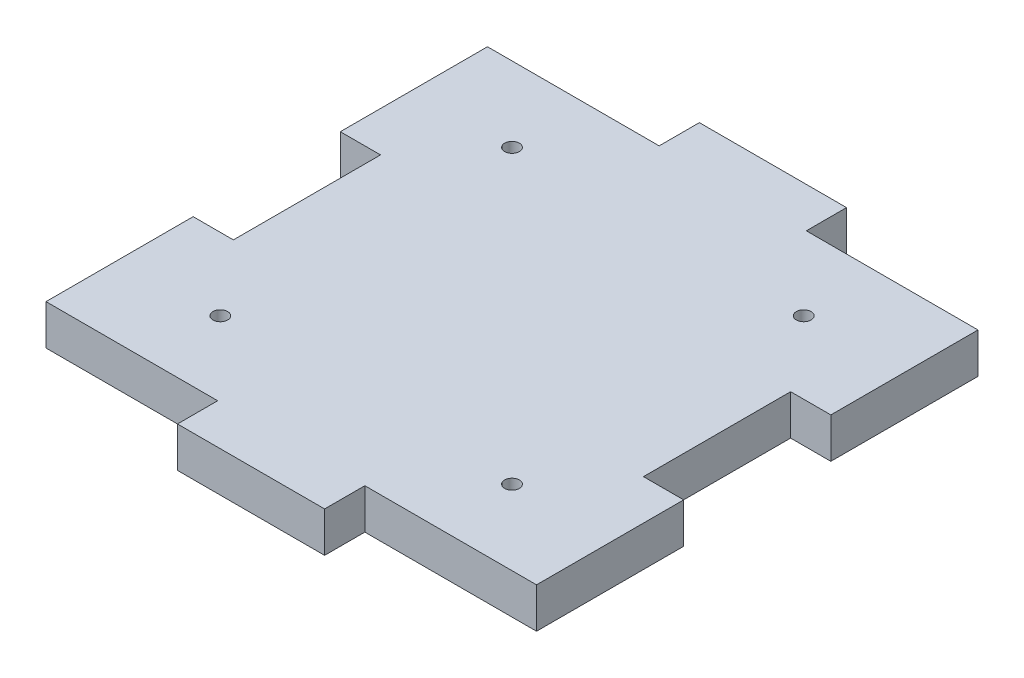
ISO-10303-21;
HEADER;
FILE_DESCRIPTION(('STEP AP214'),'2;1');
FILE_NAME('part.step','',(''),(''),'','','');
FILE_SCHEMA(('AUTOMOTIVE_DESIGN { 1 0 10303 214 1 1 1 1 }'));
ENDSEC;
DATA;
#1=APPLICATION_CONTEXT('core data for automotive mechanical design processes');
#2=APPLICATION_PROTOCOL_DEFINITION('international standard','automotive_design',2000,#1);
#3=PRODUCT_CONTEXT('',#1,'mechanical');
#4=PRODUCT('Part','Part','',(#3));
#5=PRODUCT_RELATED_PRODUCT_CATEGORY('part','',(#4));
#6=PRODUCT_DEFINITION_FORMATION('','',#4);
#7=PRODUCT_DEFINITION_CONTEXT('part definition',#1,'design');
#8=PRODUCT_DEFINITION('design','',#6,#7);
#9=PRODUCT_DEFINITION_SHAPE('','',#8);
#10=(LENGTH_UNIT() NAMED_UNIT(*) SI_UNIT(.MILLI.,.METRE.));
#11=(NAMED_UNIT(*) PLANE_ANGLE_UNIT() SI_UNIT($,.RADIAN.));
#12=(NAMED_UNIT(*) SI_UNIT($,.STERADIAN.) SOLID_ANGLE_UNIT());
#13=UNCERTAINTY_MEASURE_WITH_UNIT(LENGTH_MEASURE(1.E-05),#10,'distance_accuracy_value','');
#14=(GEOMETRIC_REPRESENTATION_CONTEXT(3) GLOBAL_UNCERTAINTY_ASSIGNED_CONTEXT((#13)) GLOBAL_UNIT_ASSIGNED_CONTEXT((#10,
#11,#12)) REPRESENTATION_CONTEXT('',''));
#15=CARTESIAN_POINT('',(0.,0.,0.));
#16=DIRECTION('',(0.,0.,1.));
#17=DIRECTION('',(1.,0.,0.));
#18=AXIS2_PLACEMENT_3D('',#15,#16,#17);
#19=CARTESIAN_POINT('',(0.,4.1,0.));
#20=DIRECTION('',(0.,-1.,0.));
#21=DIRECTION('',(0.,0.,-1.));
#22=AXIS2_PLACEMENT_3D('',#19,#20,#21);
#23=PLANE('',#22);
#24=CARTESIAN_POINT('',(39.8669200744472,4.1,-37.3669200744472));
#25=DIRECTION('',(0.,1.,0.));
#26=DIRECTION('',(0.,0.,1.));
#27=AXIS2_PLACEMENT_3D('',#24,#25,#26);
#28=CIRCLE('',#27,0.749999999999999);
#29=CARTESIAN_POINT('',(39.8669200744472,4.1,-36.6169200744472));
#30=VERTEX_POINT('',#29);
#31=EDGE_CURVE('E395',#30,#30,#28,.T.);
#32=ORIENTED_EDGE('',*,*,#31,.F.);
#33=EDGE_LOOP('',(#32));
#34=FACE_BOUND('',#33,.T.);
#35=CARTESIAN_POINT('',(10.1330799255528,4.1,-7.63307992555285));
#36=DIRECTION('',(0.,1.,0.));
#37=DIRECTION('',(0.,0.,1.));
#38=AXIS2_PLACEMENT_3D('',#35,#36,#37);
#39=CIRCLE('',#38,0.75);
#40=CARTESIAN_POINT('',(10.1330799255528,4.1,-6.88307992555285));
#41=VERTEX_POINT('',#40);
#42=EDGE_CURVE('E205',#41,#41,#39,.T.);
#43=ORIENTED_EDGE('',*,*,#42,.F.);
#44=EDGE_LOOP('',(#43));
#45=FACE_BOUND('',#44,.T.);
#46=DIRECTION('',(1.,0.,0.));
#47=VECTOR('',#46,1.);
#48=CARTESIAN_POINT('',(17.5,4.1,0.));
#49=LINE('',#48,#47);
#50=CARTESIAN_POINT('',(0.,4.1,0.));
#51=VERTEX_POINT('',#50);
#52=CARTESIAN_POINT('',(17.5,4.1,0.));
#53=VERTEX_POINT('',#52);
#54=EDGE_CURVE('E240',#51,#53,#49,.T.);
#55=ORIENTED_EDGE('',*,*,#54,.T.);
#56=DIRECTION('',(0.,0.,1.));
#57=VECTOR('',#56,1.);
#58=CARTESIAN_POINT('',(17.5,4.1,4.10000000000001));
#59=LINE('',#58,#57);
#60=CARTESIAN_POINT('',(17.5,4.1,4.10000000000001));
#61=VERTEX_POINT('',#60);
#62=EDGE_CURVE('E128',#53,#61,#59,.T.);
#63=ORIENTED_EDGE('',*,*,#62,.T.);
#64=DIRECTION('',(1.,0.,0.));
#65=VECTOR('',#64,1.);
#66=CARTESIAN_POINT('',(32.5,4.1,4.10000000000001));
#67=LINE('',#66,#65);
#68=CARTESIAN_POINT('',(32.5,4.1,4.10000000000001));
#69=VERTEX_POINT('',#68);
#70=EDGE_CURVE('E291',#61,#69,#67,.T.);
#71=ORIENTED_EDGE('',*,*,#70,.T.);
#72=DIRECTION('',(0.,0.,-1.));
#73=VECTOR('',#72,1.);
#74=CARTESIAN_POINT('',(32.5,4.1,0.));
#75=LINE('',#74,#73);
#76=CARTESIAN_POINT('',(32.5,4.1,0.));
#77=VERTEX_POINT('',#76);
#78=EDGE_CURVE('E310',#69,#77,#75,.T.);
#79=ORIENTED_EDGE('',*,*,#78,.T.);
#80=DIRECTION('',(1.,0.,0.));
#81=VECTOR('',#80,1.);
#82=CARTESIAN_POINT('',(50.,4.1,0.));
#83=LINE('',#82,#81);
#84=CARTESIAN_POINT('',(50.,4.1,0.));
#85=VERTEX_POINT('',#84);
#86=EDGE_CURVE('E307',#77,#85,#83,.T.);
#87=ORIENTED_EDGE('',*,*,#86,.T.);
#88=DIRECTION('',(0.,0.,-1.));
#89=VECTOR('',#88,1.);
#90=CARTESIAN_POINT('',(50.,4.1,-15.));
#91=LINE('',#90,#89);
#92=CARTESIAN_POINT('',(50.,4.1,-15.));
#93=VERTEX_POINT('',#92);
#94=EDGE_CURVE('E309',#85,#93,#91,.T.);
#95=ORIENTED_EDGE('',*,*,#94,.T.);
#96=DIRECTION('',(-1.,0.,0.));
#97=VECTOR('',#96,1.);
#98=CARTESIAN_POINT('',(45.9,4.1,-15.));
#99=LINE('',#98,#97);
#100=CARTESIAN_POINT('',(45.9,4.1,-15.));
#101=VERTEX_POINT('',#100);
#102=EDGE_CURVE('E312',#93,#101,#99,.T.);
#103=ORIENTED_EDGE('',*,*,#102,.T.);
#104=DIRECTION('',(0.,0.,-1.));
#105=VECTOR('',#104,1.);
#106=CARTESIAN_POINT('',(45.9,4.1,-30.));
#107=LINE('',#106,#105);
#108=CARTESIAN_POINT('',(45.9,4.1,-30.));
#109=VERTEX_POINT('',#108);
#110=EDGE_CURVE('E318',#101,#109,#107,.T.);
#111=ORIENTED_EDGE('',*,*,#110,.T.);
#112=DIRECTION('',(1.,0.,0.));
#113=VECTOR('',#112,1.);
#114=CARTESIAN_POINT('',(50.,4.1,-30.));
#115=LINE('',#114,#113);
#116=CARTESIAN_POINT('',(50.,4.1,-30.));
#117=VERTEX_POINT('',#116);
#118=EDGE_CURVE('E320',#109,#117,#115,.T.);
#119=ORIENTED_EDGE('',*,*,#118,.T.);
#120=DIRECTION('',(0.,0.,-1.));
#121=VECTOR('',#120,1.);
#122=CARTESIAN_POINT('',(50.,4.1,-45.));
#123=LINE('',#122,#121);
#124=CARTESIAN_POINT('',(50.,4.1,-45.));
#125=VERTEX_POINT('',#124);
#126=EDGE_CURVE('E322',#117,#125,#123,.T.);
#127=ORIENTED_EDGE('',*,*,#126,.T.);
#128=DIRECTION('',(-1.,0.,0.));
#129=VECTOR('',#128,1.);
#130=CARTESIAN_POINT('',(50.,4.1,-45.));
#131=LINE('',#130,#129);
#132=CARTESIAN_POINT('',(32.5,4.1,-45.));
#133=VERTEX_POINT('',#132);
#134=EDGE_CURVE('E324',#125,#133,#131,.T.);
#135=ORIENTED_EDGE('',*,*,#134,.T.);
#136=DIRECTION('',(0.,0.,-1.));
#137=VECTOR('',#136,1.);
#138=CARTESIAN_POINT('',(32.5,4.1,-45.));
#139=LINE('',#138,#137);
#140=CARTESIAN_POINT('',(32.5,4.1,-49.1));
#141=VERTEX_POINT('',#140);
#142=EDGE_CURVE('E326',#133,#141,#139,.T.);
#143=ORIENTED_EDGE('',*,*,#142,.T.);
#144=DIRECTION('',(-1.,0.,0.));
#145=VECTOR('',#144,1.);
#146=CARTESIAN_POINT('',(32.5,4.1,-49.1));
#147=LINE('',#146,#145);
#148=CARTESIAN_POINT('',(17.5,4.1,-49.1));
#149=VERTEX_POINT('',#148);
#150=EDGE_CURVE('E328',#141,#149,#147,.T.);
#151=ORIENTED_EDGE('',*,*,#150,.T.);
#152=DIRECTION('',(0.,0.,1.));
#153=VECTOR('',#152,1.);
#154=CARTESIAN_POINT('',(17.5,4.1,-49.1));
#155=LINE('',#154,#153);
#156=CARTESIAN_POINT('',(17.5,4.1,-45.));
#157=VERTEX_POINT('',#156);
#158=EDGE_CURVE('E330',#149,#157,#155,.T.);
#159=ORIENTED_EDGE('',*,*,#158,.T.);
#160=DIRECTION('',(-1.,0.,0.));
#161=VECTOR('',#160,1.);
#162=CARTESIAN_POINT('',(17.5,4.1,-45.));
#163=LINE('',#162,#161);
#164=CARTESIAN_POINT('',(0.,4.1,-45.));
#165=VERTEX_POINT('',#164);
#166=EDGE_CURVE('E332',#157,#165,#163,.T.);
#167=ORIENTED_EDGE('',*,*,#166,.T.);
#168=DIRECTION('',(0.,0.,1.));
#169=VECTOR('',#168,1.);
#170=CARTESIAN_POINT('',(0.,4.1,-30.));
#171=LINE('',#170,#169);
#172=CARTESIAN_POINT('',(0.,4.1,-30.));
#173=VERTEX_POINT('',#172);
#174=EDGE_CURVE('E334',#165,#173,#171,.T.);
#175=ORIENTED_EDGE('',*,*,#174,.T.);
#176=DIRECTION('',(1.,0.,0.));
#177=VECTOR('',#176,1.);
#178=CARTESIAN_POINT('',(4.1,4.1,-30.));
#179=LINE('',#178,#177);
#180=CARTESIAN_POINT('',(4.1,4.1,-30.));
#181=VERTEX_POINT('',#180);
#182=EDGE_CURVE('E183',#173,#181,#179,.T.);
#183=ORIENTED_EDGE('',*,*,#182,.T.);
#184=DIRECTION('',(0.,0.,1.));
#185=VECTOR('',#184,1.);
#186=CARTESIAN_POINT('',(4.1,4.1,-15.));
#187=LINE('',#186,#185);
#188=CARTESIAN_POINT('',(4.1,4.1,-15.));
#189=VERTEX_POINT('',#188);
#190=EDGE_CURVE('E177',#181,#189,#187,.T.);
#191=ORIENTED_EDGE('',*,*,#190,.T.);
#192=DIRECTION('',(-1.,0.,0.));
#193=VECTOR('',#192,1.);
#194=CARTESIAN_POINT('',(0.,4.1,-15.));
#195=LINE('',#194,#193);
#196=CARTESIAN_POINT('',(0.,4.1,-15.));
#197=VERTEX_POINT('',#196);
#198=EDGE_CURVE('E181',#189,#197,#195,.T.);
#199=ORIENTED_EDGE('',*,*,#198,.T.);
#200=DIRECTION('',(0.,0.,1.));
#201=VECTOR('',#200,1.);
#202=CARTESIAN_POINT('',(0.,4.1,0.));
#203=LINE('',#202,#201);
#204=EDGE_CURVE('E49',#197,#51,#203,.T.);
#205=ORIENTED_EDGE('',*,*,#204,.T.);
#206=EDGE_LOOP('',(#55,#63,#71,#79,#87,#95,#103,#111,#119,#127,#135,#143,#151,#159,#167,#175,
#183,#191,#199,#205));
#207=FACE_BOUND('',#206,.T.);
#208=CARTESIAN_POINT('',(10.1330799255528,4.1,-37.3669200744472));
#209=DIRECTION('',(0.,1.,0.));
#210=DIRECTION('',(0.,0.,1.));
#211=AXIS2_PLACEMENT_3D('',#208,#209,#210);
#212=CIRCLE('',#211,0.75);
#213=CARTESIAN_POINT('',(10.1330799255528,4.1,-36.6169200744472));
#214=VERTEX_POINT('',#213);
#215=EDGE_CURVE('E401',#214,#214,#212,.T.);
#216=ORIENTED_EDGE('',*,*,#215,.F.);
#217=EDGE_LOOP('',(#216));
#218=FACE_BOUND('',#217,.T.);
#219=CARTESIAN_POINT('',(39.8669200744472,4.1,-7.63307992555285));
#220=DIRECTION('',(0.,1.,0.));
#221=DIRECTION('',(0.,0.,1.));
#222=AXIS2_PLACEMENT_3D('',#219,#220,#221);
#223=CIRCLE('',#222,0.749999999999999);
#224=CARTESIAN_POINT('',(39.8669200744472,4.1,-6.88307992555285));
#225=VERTEX_POINT('',#224);
#226=EDGE_CURVE('E386',#225,#225,#223,.T.);
#227=ORIENTED_EDGE('',*,*,#226,.F.);
#228=EDGE_LOOP('',(#227));
#229=FACE_BOUND('',#228,.T.);
#230=ADVANCED_FACE('F32',(#34,#45,#207,#218,#229),#23,.F.);
#231=CARTESIAN_POINT('',(0.,0.,0.));
#232=DIRECTION('',(0.,-1.,0.));
#233=DIRECTION('',(0.,0.,-1.));
#234=AXIS2_PLACEMENT_3D('',#231,#232,#233);
#235=PLANE('',#234);
#236=CARTESIAN_POINT('',(39.8669200744472,0.,-37.3669200744472));
#237=DIRECTION('',(0.,1.,0.));
#238=DIRECTION('',(0.,0.,1.));
#239=AXIS2_PLACEMENT_3D('',#236,#237,#238);
#240=CIRCLE('',#239,0.749999999999999);
#241=CARTESIAN_POINT('',(39.8669200744472,0.,-36.6169200744472));
#242=VERTEX_POINT('',#241);
#243=EDGE_CURVE('E392',#242,#242,#240,.T.);
#244=ORIENTED_EDGE('',*,*,#243,.T.);
#245=EDGE_LOOP('',(#244));
#246=FACE_BOUND('',#245,.T.);
#247=CARTESIAN_POINT('',(10.1330799255528,0.,-7.63307992555285));
#248=DIRECTION('',(0.,1.,0.));
#249=DIRECTION('',(0.,0.,1.));
#250=AXIS2_PLACEMENT_3D('',#247,#248,#249);
#251=CIRCLE('',#250,0.75);
#252=CARTESIAN_POINT('',(10.1330799255528,0.,-6.88307992555285));
#253=VERTEX_POINT('',#252);
#254=EDGE_CURVE('E404',#253,#253,#251,.T.);
#255=ORIENTED_EDGE('',*,*,#254,.T.);
#256=EDGE_LOOP('',(#255));
#257=FACE_BOUND('',#256,.T.);
#258=DIRECTION('',(1.,0.,0.));
#259=VECTOR('',#258,1.);
#260=CARTESIAN_POINT('',(17.5,0.,0.));
#261=LINE('',#260,#259);
#262=CARTESIAN_POINT('',(0.,0.,0.));
#263=VERTEX_POINT('',#262);
#264=CARTESIAN_POINT('',(17.5,0.,0.));
#265=VERTEX_POINT('',#264);
#266=EDGE_CURVE('E201',#263,#265,#261,.T.);
#267=ORIENTED_EDGE('',*,*,#266,.F.);
#268=DIRECTION('',(0.,0.,1.));
#269=VECTOR('',#268,1.);
#270=CARTESIAN_POINT('',(0.,0.,0.));
#271=LINE('',#270,#269);
#272=CARTESIAN_POINT('',(0.,0.,-15.));
#273=VERTEX_POINT('',#272);
#274=EDGE_CURVE('E120',#273,#263,#271,.T.);
#275=ORIENTED_EDGE('',*,*,#274,.F.);
#276=DIRECTION('',(-1.,0.,0.));
#277=VECTOR('',#276,1.);
#278=CARTESIAN_POINT('',(0.,0.,-15.));
#279=LINE('',#278,#277);
#280=CARTESIAN_POINT('',(4.1,0.,-15.));
#281=VERTEX_POINT('',#280);
#282=EDGE_CURVE('E114',#281,#273,#279,.T.);
#283=ORIENTED_EDGE('',*,*,#282,.F.);
#284=DIRECTION('',(0.,0.,1.));
#285=VECTOR('',#284,1.);
#286=CARTESIAN_POINT('',(4.1,0.,-15.));
#287=LINE('',#286,#285);
#288=CARTESIAN_POINT('',(4.1,0.,-30.));
#289=VERTEX_POINT('',#288);
#290=EDGE_CURVE('E191',#289,#281,#287,.T.);
#291=ORIENTED_EDGE('',*,*,#290,.F.);
#292=DIRECTION('',(1.,0.,0.));
#293=VECTOR('',#292,1.);
#294=CARTESIAN_POINT('',(4.1,0.,-30.));
#295=LINE('',#294,#293);
#296=CARTESIAN_POINT('',(0.,0.,-30.));
#297=VERTEX_POINT('',#296);
#298=EDGE_CURVE('E235',#297,#289,#295,.T.);
#299=ORIENTED_EDGE('',*,*,#298,.F.);
#300=DIRECTION('',(0.,0.,1.));
#301=VECTOR('',#300,1.);
#302=CARTESIAN_POINT('',(0.,0.,-30.));
#303=LINE('',#302,#301);
#304=CARTESIAN_POINT('',(0.,0.,-45.));
#305=VERTEX_POINT('',#304);
#306=EDGE_CURVE('E233',#305,#297,#303,.T.);
#307=ORIENTED_EDGE('',*,*,#306,.F.);
#308=DIRECTION('',(-1.,0.,0.));
#309=VECTOR('',#308,1.);
#310=CARTESIAN_POINT('',(17.5,0.,-45.));
#311=LINE('',#310,#309);
#312=CARTESIAN_POINT('',(17.5,0.,-45.));
#313=VERTEX_POINT('',#312);
#314=EDGE_CURVE('E231',#313,#305,#311,.T.);
#315=ORIENTED_EDGE('',*,*,#314,.F.);
#316=DIRECTION('',(0.,0.,1.));
#317=VECTOR('',#316,1.);
#318=CARTESIAN_POINT('',(17.5,0.,-49.1));
#319=LINE('',#318,#317);
#320=CARTESIAN_POINT('',(17.5,0.,-49.1));
#321=VERTEX_POINT('',#320);
#322=EDGE_CURVE('E229',#321,#313,#319,.T.);
#323=ORIENTED_EDGE('',*,*,#322,.F.);
#324=DIRECTION('',(-1.,0.,0.));
#325=VECTOR('',#324,1.);
#326=CARTESIAN_POINT('',(32.5,0.,-49.1));
#327=LINE('',#326,#325);
#328=CARTESIAN_POINT('',(32.5,0.,-49.1));
#329=VERTEX_POINT('',#328);
#330=EDGE_CURVE('E227',#329,#321,#327,.T.);
#331=ORIENTED_EDGE('',*,*,#330,.F.);
#332=DIRECTION('',(0.,0.,-1.));
#333=VECTOR('',#332,1.);
#334=CARTESIAN_POINT('',(32.5,0.,-45.));
#335=LINE('',#334,#333);
#336=CARTESIAN_POINT('',(32.5,0.,-45.));
#337=VERTEX_POINT('',#336);
#338=EDGE_CURVE('E225',#337,#329,#335,.T.);
#339=ORIENTED_EDGE('',*,*,#338,.F.);
#340=DIRECTION('',(-1.,0.,0.));
#341=VECTOR('',#340,1.);
#342=CARTESIAN_POINT('',(50.,0.,-45.));
#343=LINE('',#342,#341);
#344=CARTESIAN_POINT('',(50.,0.,-45.));
#345=VERTEX_POINT('',#344);
#346=EDGE_CURVE('E223',#345,#337,#343,.T.);
#347=ORIENTED_EDGE('',*,*,#346,.F.);
#348=DIRECTION('',(0.,0.,-1.));
#349=VECTOR('',#348,1.);
#350=CARTESIAN_POINT('',(50.,0.,-45.));
#351=LINE('',#350,#349);
#352=CARTESIAN_POINT('',(50.,0.,-30.));
#353=VERTEX_POINT('',#352);
#354=EDGE_CURVE('E221',#353,#345,#351,.T.);
#355=ORIENTED_EDGE('',*,*,#354,.F.);
#356=DIRECTION('',(1.,0.,0.));
#357=VECTOR('',#356,1.);
#358=CARTESIAN_POINT('',(50.,0.,-30.));
#359=LINE('',#358,#357);
#360=CARTESIAN_POINT('',(45.9,0.,-30.));
#361=VERTEX_POINT('',#360);
#362=EDGE_CURVE('E219',#361,#353,#359,.T.);
#363=ORIENTED_EDGE('',*,*,#362,.F.);
#364=DIRECTION('',(0.,0.,-1.));
#365=VECTOR('',#364,1.);
#366=CARTESIAN_POINT('',(45.9,0.,-30.));
#367=LINE('',#366,#365);
#368=CARTESIAN_POINT('',(45.9,0.,-15.));
#369=VERTEX_POINT('',#368);
#370=EDGE_CURVE('E217',#369,#361,#367,.T.);
#371=ORIENTED_EDGE('',*,*,#370,.F.);
#372=DIRECTION('',(-1.,0.,0.));
#373=VECTOR('',#372,1.);
#374=CARTESIAN_POINT('',(45.9,0.,-15.));
#375=LINE('',#374,#373);
#376=CARTESIAN_POINT('',(50.,0.,-15.));
#377=VERTEX_POINT('',#376);
#378=EDGE_CURVE('E215',#377,#369,#375,.T.);
#379=ORIENTED_EDGE('',*,*,#378,.F.);
#380=DIRECTION('',(0.,0.,-1.));
#381=VECTOR('',#380,1.);
#382=CARTESIAN_POINT('',(50.,0.,-15.));
#383=LINE('',#382,#381);
#384=CARTESIAN_POINT('',(50.,0.,0.));
#385=VERTEX_POINT('',#384);
#386=EDGE_CURVE('E213',#385,#377,#383,.T.);
#387=ORIENTED_EDGE('',*,*,#386,.F.);
#388=DIRECTION('',(1.,0.,0.));
#389=VECTOR('',#388,1.);
#390=CARTESIAN_POINT('',(50.,0.,0.));
#391=LINE('',#390,#389);
#392=CARTESIAN_POINT('',(32.5,0.,0.));
#393=VERTEX_POINT('',#392);
#394=EDGE_CURVE('E211',#393,#385,#391,.T.);
#395=ORIENTED_EDGE('',*,*,#394,.F.);
#396=DIRECTION('',(0.,0.,-1.));
#397=VECTOR('',#396,1.);
#398=CARTESIAN_POINT('',(32.5,0.,0.));
#399=LINE('',#398,#397);
#400=CARTESIAN_POINT('',(32.5,0.,4.10000000000001));
#401=VERTEX_POINT('',#400);
#402=EDGE_CURVE('E209',#401,#393,#399,.T.);
#403=ORIENTED_EDGE('',*,*,#402,.F.);
#404=DIRECTION('',(1.,0.,0.));
#405=VECTOR('',#404,1.);
#406=CARTESIAN_POINT('',(32.5,0.,4.10000000000001));
#407=LINE('',#406,#405);
#408=CARTESIAN_POINT('',(17.5,0.,4.10000000000001));
#409=VERTEX_POINT('',#408);
#410=EDGE_CURVE('E207',#409,#401,#407,.T.);
#411=ORIENTED_EDGE('',*,*,#410,.F.);
#412=DIRECTION('',(0.,0.,1.));
#413=VECTOR('',#412,1.);
#414=CARTESIAN_POINT('',(17.5,0.,4.10000000000001));
#415=LINE('',#414,#413);
#416=EDGE_CURVE('E204',#265,#409,#415,.T.);
#417=ORIENTED_EDGE('',*,*,#416,.F.);
#418=EDGE_LOOP('',(#267,#275,#283,#291,#299,#307,#315,#323,#331,#339,#347,#355,#363,#371,#379,
#387,#395,#403,#411,#417));
#419=FACE_BOUND('',#418,.T.);
#420=CARTESIAN_POINT('',(10.1330799255528,0.,-37.3669200744472));
#421=DIRECTION('',(0.,1.,0.));
#422=DIRECTION('',(0.,0.,1.));
#423=AXIS2_PLACEMENT_3D('',#420,#421,#422);
#424=CIRCLE('',#423,0.75);
#425=CARTESIAN_POINT('',(10.1330799255528,0.,-36.6169200744472));
#426=VERTEX_POINT('',#425);
#427=EDGE_CURVE('E398',#426,#426,#424,.T.);
#428=ORIENTED_EDGE('',*,*,#427,.T.);
#429=EDGE_LOOP('',(#428));
#430=FACE_BOUND('',#429,.T.);
#431=CARTESIAN_POINT('',(39.8669200744472,0.,-7.63307992555285));
#432=DIRECTION('',(0.,1.,0.));
#433=DIRECTION('',(0.,0.,1.));
#434=AXIS2_PLACEMENT_3D('',#431,#432,#433);
#435=CIRCLE('',#434,0.749999999999999);
#436=CARTESIAN_POINT('',(39.8669200744472,0.,-6.88307992555285));
#437=VERTEX_POINT('',#436);
#438=EDGE_CURVE('E389',#437,#437,#435,.T.);
#439=ORIENTED_EDGE('',*,*,#438,.T.);
#440=EDGE_LOOP('',(#439));
#441=FACE_BOUND('',#440,.T.);
#442=ADVANCED_FACE('F295',(#246,#257,#419,#430,#441),#235,.T.);
#443=CARTESIAN_POINT('',(17.5,4.1,0.));
#444=DIRECTION('',(0.,0.,-1.));
#445=DIRECTION('',(-1.,0.,0.));
#446=AXIS2_PLACEMENT_3D('',#443,#444,#445);
#447=PLANE('',#446);
#448=ORIENTED_EDGE('',*,*,#266,.T.);
#449=DIRECTION('',(0.,-1.,0.));
#450=VECTOR('',#449,1.);
#451=CARTESIAN_POINT('',(17.5,4.1,0.));
#452=LINE('',#451,#450);
#453=EDGE_CURVE('E11',#53,#265,#452,.T.);
#454=ORIENTED_EDGE('',*,*,#453,.F.);
#455=ORIENTED_EDGE('',*,*,#54,.F.);
#456=DIRECTION('',(0.,-1.,0.));
#457=VECTOR('',#456,1.);
#458=CARTESIAN_POINT('',(0.,4.1,0.));
#459=LINE('',#458,#457);
#460=EDGE_CURVE('E197',#51,#263,#459,.T.);
#461=ORIENTED_EDGE('',*,*,#460,.T.);
#462=EDGE_LOOP('',(#448,#454,#455,#461));
#463=FACE_BOUND('',#462,.T.);
#464=ADVANCED_FACE('F34',(#463),#447,.F.);
#465=CARTESIAN_POINT('',(17.5,4.1,4.10000000000001));
#466=DIRECTION('',(1.,0.,0.));
#467=DIRECTION('',(0.,0.,-1.));
#468=AXIS2_PLACEMENT_3D('',#465,#466,#467);
#469=PLANE('',#468);
#470=ORIENTED_EDGE('',*,*,#416,.T.);
#471=DIRECTION('',(0.,-1.,0.));
#472=VECTOR('',#471,1.);
#473=CARTESIAN_POINT('',(17.5,4.1,4.10000000000001));
#474=LINE('',#473,#472);
#475=EDGE_CURVE('E41',#61,#409,#474,.T.);
#476=ORIENTED_EDGE('',*,*,#475,.F.);
#477=ORIENTED_EDGE('',*,*,#62,.F.);
#478=ORIENTED_EDGE('',*,*,#453,.T.);
#479=EDGE_LOOP('',(#470,#476,#477,#478));
#480=FACE_BOUND('',#479,.T.);
#481=ADVANCED_FACE('F593',(#480),#469,.F.);
#482=CARTESIAN_POINT('',(32.5,4.1,4.10000000000001));
#483=DIRECTION('',(0.,0.,-1.));
#484=DIRECTION('',(-1.,0.,0.));
#485=AXIS2_PLACEMENT_3D('',#482,#483,#484);
#486=PLANE('',#485);
#487=ORIENTED_EDGE('',*,*,#410,.T.);
#488=DIRECTION('',(0.,-1.,0.));
#489=VECTOR('',#488,1.);
#490=CARTESIAN_POINT('',(32.5,4.1,4.10000000000001));
#491=LINE('',#490,#489);
#492=EDGE_CURVE('E283',#69,#401,#491,.T.);
#493=ORIENTED_EDGE('',*,*,#492,.F.);
#494=ORIENTED_EDGE('',*,*,#70,.F.);
#495=ORIENTED_EDGE('',*,*,#475,.T.);
#496=EDGE_LOOP('',(#487,#493,#494,#495));
#497=FACE_BOUND('',#496,.T.);
#498=ADVANCED_FACE('F289',(#497),#486,.F.);
#499=CARTESIAN_POINT('',(32.5,4.1,0.));
#500=DIRECTION('',(-1.,0.,0.));
#501=DIRECTION('',(0.,0.,1.));
#502=AXIS2_PLACEMENT_3D('',#499,#500,#501);
#503=PLANE('',#502);
#504=ORIENTED_EDGE('',*,*,#402,.T.);
#505=DIRECTION('',(0.,-1.,0.));
#506=VECTOR('',#505,1.);
#507=CARTESIAN_POINT('',(32.5,4.1,0.));
#508=LINE('',#507,#506);
#509=EDGE_CURVE('E280',#77,#393,#508,.T.);
#510=ORIENTED_EDGE('',*,*,#509,.F.);
#511=ORIENTED_EDGE('',*,*,#78,.F.);
#512=ORIENTED_EDGE('',*,*,#492,.T.);
#513=EDGE_LOOP('',(#504,#510,#511,#512));
#514=FACE_BOUND('',#513,.T.);
#515=ADVANCED_FACE('F301',(#514),#503,.F.);
#516=CARTESIAN_POINT('',(50.,4.1,0.));
#517=DIRECTION('',(0.,0.,-1.));
#518=DIRECTION('',(-1.,0.,0.));
#519=AXIS2_PLACEMENT_3D('',#516,#517,#518);
#520=PLANE('',#519);
#521=ORIENTED_EDGE('',*,*,#394,.T.);
#522=DIRECTION('',(0.,-1.,0.));
#523=VECTOR('',#522,1.);
#524=CARTESIAN_POINT('',(50.,4.1,0.));
#525=LINE('',#524,#523);
#526=EDGE_CURVE('E277',#85,#385,#525,.T.);
#527=ORIENTED_EDGE('',*,*,#526,.F.);
#528=ORIENTED_EDGE('',*,*,#86,.F.);
#529=ORIENTED_EDGE('',*,*,#509,.T.);
#530=EDGE_LOOP('',(#521,#527,#528,#529));
#531=FACE_BOUND('',#530,.T.);
#532=ADVANCED_FACE('F305',(#531),#520,.F.);
#533=CARTESIAN_POINT('',(50.,4.1,-15.));
#534=DIRECTION('',(-1.,0.,0.));
#535=DIRECTION('',(0.,0.,1.));
#536=AXIS2_PLACEMENT_3D('',#533,#534,#535);
#537=PLANE('',#536);
#538=ORIENTED_EDGE('',*,*,#386,.T.);
#539=DIRECTION('',(0.,-1.,0.));
#540=VECTOR('',#539,1.);
#541=CARTESIAN_POINT('',(50.,4.1,-15.));
#542=LINE('',#541,#540);
#543=EDGE_CURVE('E274',#93,#377,#542,.T.);
#544=ORIENTED_EDGE('',*,*,#543,.F.);
#545=ORIENTED_EDGE('',*,*,#94,.F.);
#546=ORIENTED_EDGE('',*,*,#526,.T.);
#547=EDGE_LOOP('',(#538,#544,#545,#546));
#548=FACE_BOUND('',#547,.T.);
#549=ADVANCED_FACE('F558',(#548),#537,.F.);
#550=CARTESIAN_POINT('',(45.9,4.1,-15.));
#551=DIRECTION('',(0.,0.,1.));
#552=DIRECTION('',(1.,0.,0.));
#553=AXIS2_PLACEMENT_3D('',#550,#551,#552);
#554=PLANE('',#553);
#555=ORIENTED_EDGE('',*,*,#378,.T.);
#556=DIRECTION('',(0.,-1.,0.));
#557=VECTOR('',#556,1.);
#558=CARTESIAN_POINT('',(45.9,4.1,-15.));
#559=LINE('',#558,#557);
#560=EDGE_CURVE('E271',#101,#369,#559,.T.);
#561=ORIENTED_EDGE('',*,*,#560,.F.);
#562=ORIENTED_EDGE('',*,*,#102,.F.);
#563=ORIENTED_EDGE('',*,*,#543,.T.);
#564=EDGE_LOOP('',(#555,#561,#562,#563));
#565=FACE_BOUND('',#564,.T.);
#566=ADVANCED_FACE('F548',(#565),#554,.F.);
#567=CARTESIAN_POINT('',(45.9,4.1,-30.));
#568=DIRECTION('',(-1.,0.,0.));
#569=DIRECTION('',(0.,0.,1.));
#570=AXIS2_PLACEMENT_3D('',#567,#568,#569);
#571=PLANE('',#570);
#572=ORIENTED_EDGE('',*,*,#370,.T.);
#573=DIRECTION('',(0.,-1.,0.));
#574=VECTOR('',#573,1.);
#575=CARTESIAN_POINT('',(45.9,4.1,-30.));
#576=LINE('',#575,#574);
#577=EDGE_CURVE('E268',#109,#361,#576,.T.);
#578=ORIENTED_EDGE('',*,*,#577,.F.);
#579=ORIENTED_EDGE('',*,*,#110,.F.);
#580=ORIENTED_EDGE('',*,*,#560,.T.);
#581=EDGE_LOOP('',(#572,#578,#579,#580));
#582=FACE_BOUND('',#581,.T.);
#583=ADVANCED_FACE('F538',(#582),#571,.F.);
#584=CARTESIAN_POINT('',(50.,4.1,-30.));
#585=DIRECTION('',(0.,0.,-1.));
#586=DIRECTION('',(-1.,0.,0.));
#587=AXIS2_PLACEMENT_3D('',#584,#585,#586);
#588=PLANE('',#587);
#589=ORIENTED_EDGE('',*,*,#362,.T.);
#590=DIRECTION('',(0.,-1.,0.));
#591=VECTOR('',#590,1.);
#592=CARTESIAN_POINT('',(50.,4.1,-30.));
#593=LINE('',#592,#591);
#594=EDGE_CURVE('E265',#117,#353,#593,.T.);
#595=ORIENTED_EDGE('',*,*,#594,.F.);
#596=ORIENTED_EDGE('',*,*,#118,.F.);
#597=ORIENTED_EDGE('',*,*,#577,.T.);
#598=EDGE_LOOP('',(#589,#595,#596,#597));
#599=FACE_BOUND('',#598,.T.);
#600=ADVANCED_FACE('F528',(#599),#588,.F.);
#601=CARTESIAN_POINT('',(50.,4.1,-45.));
#602=DIRECTION('',(-1.,0.,0.));
#603=DIRECTION('',(0.,0.,1.));
#604=AXIS2_PLACEMENT_3D('',#601,#602,#603);
#605=PLANE('',#604);
#606=ORIENTED_EDGE('',*,*,#354,.T.);
#607=DIRECTION('',(0.,-1.,0.));
#608=VECTOR('',#607,1.);
#609=CARTESIAN_POINT('',(50.,4.1,-45.));
#610=LINE('',#609,#608);
#611=EDGE_CURVE('E262',#125,#345,#610,.T.);
#612=ORIENTED_EDGE('',*,*,#611,.F.);
#613=ORIENTED_EDGE('',*,*,#126,.F.);
#614=ORIENTED_EDGE('',*,*,#594,.T.);
#615=EDGE_LOOP('',(#606,#612,#613,#614));
#616=FACE_BOUND('',#615,.T.);
#617=ADVANCED_FACE('F518',(#616),#605,.F.);
#618=CARTESIAN_POINT('',(50.,4.1,-45.));
#619=DIRECTION('',(0.,0.,1.));
#620=DIRECTION('',(1.,0.,0.));
#621=AXIS2_PLACEMENT_3D('',#618,#619,#620);
#622=PLANE('',#621);
#623=ORIENTED_EDGE('',*,*,#346,.T.);
#624=DIRECTION('',(0.,-1.,0.));
#625=VECTOR('',#624,1.);
#626=CARTESIAN_POINT('',(32.5,4.1,-45.));
#627=LINE('',#626,#625);
#628=EDGE_CURVE('E259',#133,#337,#627,.T.);
#629=ORIENTED_EDGE('',*,*,#628,.F.);
#630=ORIENTED_EDGE('',*,*,#134,.F.);
#631=ORIENTED_EDGE('',*,*,#611,.T.);
#632=EDGE_LOOP('',(#623,#629,#630,#631));
#633=FACE_BOUND('',#632,.T.);
#634=ADVANCED_FACE('F508',(#633),#622,.F.);
#635=CARTESIAN_POINT('',(32.5,4.1,-45.));
#636=DIRECTION('',(-1.,0.,0.));
#637=DIRECTION('',(0.,0.,1.));
#638=AXIS2_PLACEMENT_3D('',#635,#636,#637);
#639=PLANE('',#638);
#640=ORIENTED_EDGE('',*,*,#338,.T.);
#641=DIRECTION('',(0.,-1.,0.));
#642=VECTOR('',#641,1.);
#643=CARTESIAN_POINT('',(32.5,4.1,-49.1));
#644=LINE('',#643,#642);
#645=EDGE_CURVE('E256',#141,#329,#644,.T.);
#646=ORIENTED_EDGE('',*,*,#645,.F.);
#647=ORIENTED_EDGE('',*,*,#142,.F.);
#648=ORIENTED_EDGE('',*,*,#628,.T.);
#649=EDGE_LOOP('',(#640,#646,#647,#648));
#650=FACE_BOUND('',#649,.T.);
#651=ADVANCED_FACE('F498',(#650),#639,.F.);
#652=CARTESIAN_POINT('',(32.5,4.1,-49.1));
#653=DIRECTION('',(0.,0.,1.));
#654=DIRECTION('',(1.,0.,0.));
#655=AXIS2_PLACEMENT_3D('',#652,#653,#654);
#656=PLANE('',#655);
#657=ORIENTED_EDGE('',*,*,#330,.T.);
#658=DIRECTION('',(0.,-1.,0.));
#659=VECTOR('',#658,1.);
#660=CARTESIAN_POINT('',(17.5,4.1,-49.1));
#661=LINE('',#660,#659);
#662=EDGE_CURVE('E253',#149,#321,#661,.T.);
#663=ORIENTED_EDGE('',*,*,#662,.F.);
#664=ORIENTED_EDGE('',*,*,#150,.F.);
#665=ORIENTED_EDGE('',*,*,#645,.T.);
#666=EDGE_LOOP('',(#657,#663,#664,#665));
#667=FACE_BOUND('',#666,.T.);
#668=ADVANCED_FACE('F488',(#667),#656,.F.);
#669=CARTESIAN_POINT('',(17.5,4.1,-49.1));
#670=DIRECTION('',(1.,0.,0.));
#671=DIRECTION('',(0.,0.,-1.));
#672=AXIS2_PLACEMENT_3D('',#669,#670,#671);
#673=PLANE('',#672);
#674=ORIENTED_EDGE('',*,*,#322,.T.);
#675=DIRECTION('',(0.,-1.,0.));
#676=VECTOR('',#675,1.);
#677=CARTESIAN_POINT('',(17.5,4.1,-45.));
#678=LINE('',#677,#676);
#679=EDGE_CURVE('E250',#157,#313,#678,.T.);
#680=ORIENTED_EDGE('',*,*,#679,.F.);
#681=ORIENTED_EDGE('',*,*,#158,.F.);
#682=ORIENTED_EDGE('',*,*,#662,.T.);
#683=EDGE_LOOP('',(#674,#680,#681,#682));
#684=FACE_BOUND('',#683,.T.);
#685=ADVANCED_FACE('F478',(#684),#673,.F.);
#686=CARTESIAN_POINT('',(17.5,4.1,-45.));
#687=DIRECTION('',(0.,0.,1.));
#688=DIRECTION('',(1.,0.,0.));
#689=AXIS2_PLACEMENT_3D('',#686,#687,#688);
#690=PLANE('',#689);
#691=ORIENTED_EDGE('',*,*,#314,.T.);
#692=DIRECTION('',(0.,-1.,0.));
#693=VECTOR('',#692,1.);
#694=CARTESIAN_POINT('',(0.,4.1,-45.));
#695=LINE('',#694,#693);
#696=EDGE_CURVE('E247',#165,#305,#695,.T.);
#697=ORIENTED_EDGE('',*,*,#696,.F.);
#698=ORIENTED_EDGE('',*,*,#166,.F.);
#699=ORIENTED_EDGE('',*,*,#679,.T.);
#700=EDGE_LOOP('',(#691,#697,#698,#699));
#701=FACE_BOUND('',#700,.T.);
#702=ADVANCED_FACE('F469',(#701),#690,.F.);
#703=CARTESIAN_POINT('',(0.,4.1,-30.));
#704=DIRECTION('',(1.,0.,0.));
#705=DIRECTION('',(0.,0.,-1.));
#706=AXIS2_PLACEMENT_3D('',#703,#704,#705);
#707=PLANE('',#706);
#708=ORIENTED_EDGE('',*,*,#306,.T.);
#709=DIRECTION('',(0.,-1.,0.));
#710=VECTOR('',#709,1.);
#711=CARTESIAN_POINT('',(0.,4.1,-30.));
#712=LINE('',#711,#710);
#713=EDGE_CURVE('E244',#173,#297,#712,.T.);
#714=ORIENTED_EDGE('',*,*,#713,.F.);
#715=ORIENTED_EDGE('',*,*,#174,.F.);
#716=ORIENTED_EDGE('',*,*,#696,.T.);
#717=EDGE_LOOP('',(#708,#714,#715,#716));
#718=FACE_BOUND('',#717,.T.);
#719=ADVANCED_FACE('F340',(#718),#707,.F.);
#720=CARTESIAN_POINT('',(4.1,4.1,-30.));
#721=DIRECTION('',(0.,0.,-1.));
#722=DIRECTION('',(-1.,0.,0.));
#723=AXIS2_PLACEMENT_3D('',#720,#721,#722);
#724=PLANE('',#723);
#725=ORIENTED_EDGE('',*,*,#298,.T.);
#726=DIRECTION('',(0.,-1.,0.));
#727=VECTOR('',#726,1.);
#728=CARTESIAN_POINT('',(4.1,4.1,-30.));
#729=LINE('',#728,#727);
#730=EDGE_CURVE('E192',#181,#289,#729,.T.);
#731=ORIENTED_EDGE('',*,*,#730,.F.);
#732=ORIENTED_EDGE('',*,*,#182,.F.);
#733=ORIENTED_EDGE('',*,*,#713,.T.);
#734=EDGE_LOOP('',(#725,#731,#732,#733));
#735=FACE_BOUND('',#734,.T.);
#736=ADVANCED_FACE('F344',(#735),#724,.F.);
#737=CARTESIAN_POINT('',(4.1,4.1,-15.));
#738=DIRECTION('',(1.,0.,0.));
#739=DIRECTION('',(0.,0.,-1.));
#740=AXIS2_PLACEMENT_3D('',#737,#738,#739);
#741=PLANE('',#740);
#742=ORIENTED_EDGE('',*,*,#290,.T.);
#743=DIRECTION('',(0.,-1.,0.));
#744=VECTOR('',#743,1.);
#745=CARTESIAN_POINT('',(4.1,4.1,-15.));
#746=LINE('',#745,#744);
#747=EDGE_CURVE('E188',#189,#281,#746,.T.);
#748=ORIENTED_EDGE('',*,*,#747,.F.);
#749=ORIENTED_EDGE('',*,*,#190,.F.);
#750=ORIENTED_EDGE('',*,*,#730,.T.);
#751=EDGE_LOOP('',(#742,#748,#749,#750));
#752=FACE_BOUND('',#751,.T.);
#753=ADVANCED_FACE('F189',(#752),#741,.F.);
#754=CARTESIAN_POINT('',(0.,4.1,-15.));
#755=DIRECTION('',(0.,0.,1.));
#756=DIRECTION('',(1.,0.,0.));
#757=AXIS2_PLACEMENT_3D('',#754,#755,#756);
#758=PLANE('',#757);
#759=ORIENTED_EDGE('',*,*,#282,.T.);
#760=DIRECTION('',(0.,-1.,0.));
#761=VECTOR('',#760,1.);
#762=CARTESIAN_POINT('',(0.,4.1,-15.));
#763=LINE('',#762,#761);
#764=EDGE_CURVE('E193',#197,#273,#763,.T.);
#765=ORIENTED_EDGE('',*,*,#764,.F.);
#766=ORIENTED_EDGE('',*,*,#198,.F.);
#767=ORIENTED_EDGE('',*,*,#747,.T.);
#768=EDGE_LOOP('',(#759,#765,#766,#767));
#769=FACE_BOUND('',#768,.T.);
#770=ADVANCED_FACE('F195',(#769),#758,.F.);
#771=CARTESIAN_POINT('',(0.,4.1,0.));
#772=DIRECTION('',(1.,0.,0.));
#773=DIRECTION('',(0.,0.,-1.));
#774=AXIS2_PLACEMENT_3D('',#771,#772,#773);
#775=PLANE('',#774);
#776=ORIENTED_EDGE('',*,*,#274,.T.);
#777=ORIENTED_EDGE('',*,*,#460,.F.);
#778=ORIENTED_EDGE('',*,*,#204,.F.);
#779=ORIENTED_EDGE('',*,*,#764,.T.);
#780=EDGE_LOOP('',(#776,#777,#778,#779));
#781=FACE_BOUND('',#780,.T.);
#782=ADVANCED_FACE('F348',(#781),#775,.F.);
#783=CARTESIAN_POINT('',(10.1330799255528,4.1,-7.63307992555285));
#784=DIRECTION('',(0.,-1.,0.));
#785=DIRECTION('',(0.,0.,-1.));
#786=AXIS2_PLACEMENT_3D('',#783,#784,#785);
#787=CYLINDRICAL_SURFACE('',#786,0.75);
#788=ORIENTED_EDGE('',*,*,#42,.T.);
#789=EDGE_LOOP('',(#788));
#790=FACE_BOUND('',#789,.T.);
#791=ORIENTED_EDGE('',*,*,#254,.F.);
#792=EDGE_LOOP('',(#791));
#793=FACE_BOUND('',#792,.T.);
#794=ADVANCED_FACE('F350',(#790,#793),#787,.F.);
#795=CARTESIAN_POINT('',(10.1330799255528,4.1,-37.3669200744472));
#796=DIRECTION('',(0.,-1.,0.));
#797=DIRECTION('',(0.,0.,-1.));
#798=AXIS2_PLACEMENT_3D('',#795,#796,#797);
#799=CYLINDRICAL_SURFACE('',#798,0.75);
#800=ORIENTED_EDGE('',*,*,#215,.T.);
#801=EDGE_LOOP('',(#800));
#802=FACE_BOUND('',#801,.T.);
#803=ORIENTED_EDGE('',*,*,#427,.F.);
#804=EDGE_LOOP('',(#803));
#805=FACE_BOUND('',#804,.T.);
#806=ADVANCED_FACE('F356',(#802,#805),#799,.F.);
#807=CARTESIAN_POINT('',(39.8669200744472,4.1,-37.3669200744472));
#808=DIRECTION('',(0.,-1.,0.));
#809=DIRECTION('',(0.,0.,-1.));
#810=AXIS2_PLACEMENT_3D('',#807,#808,#809);
#811=CYLINDRICAL_SURFACE('',#810,0.749999999999999);
#812=ORIENTED_EDGE('',*,*,#31,.T.);
#813=EDGE_LOOP('',(#812));
#814=FACE_BOUND('',#813,.T.);
#815=ORIENTED_EDGE('',*,*,#243,.F.);
#816=EDGE_LOOP('',(#815));
#817=FACE_BOUND('',#816,.T.);
#818=ADVANCED_FACE('F373',(#814,#817),#811,.F.);
#819=CARTESIAN_POINT('',(39.8669200744472,4.1,-7.63307992555285));
#820=DIRECTION('',(0.,-1.,0.));
#821=DIRECTION('',(0.,0.,-1.));
#822=AXIS2_PLACEMENT_3D('',#819,#820,#821);
#823=CYLINDRICAL_SURFACE('',#822,0.749999999999999);
#824=ORIENTED_EDGE('',*,*,#226,.T.);
#825=EDGE_LOOP('',(#824));
#826=FACE_BOUND('',#825,.T.);
#827=ORIENTED_EDGE('',*,*,#438,.F.);
#828=EDGE_LOOP('',(#827));
#829=FACE_BOUND('',#828,.T.);
#830=ADVANCED_FACE('F377',(#826,#829),#823,.F.);
#831=CLOSED_SHELL('',(#230,#442,#464,#481,#498,#515,#532,#549,#566,#583,#600,#617,#634,#651,
#668,#685,#702,#719,#736,#753,#770,#782,#794,#806,#818,#830));
#832=MANIFOLD_SOLID_BREP('B2',#831);
#833=ADVANCED_BREP_SHAPE_REPRESENTATION('',(#18,#832),#14);
#834=SHAPE_DEFINITION_REPRESENTATION(#9,#833);
ENDSEC;
END-ISO-10303-21;
